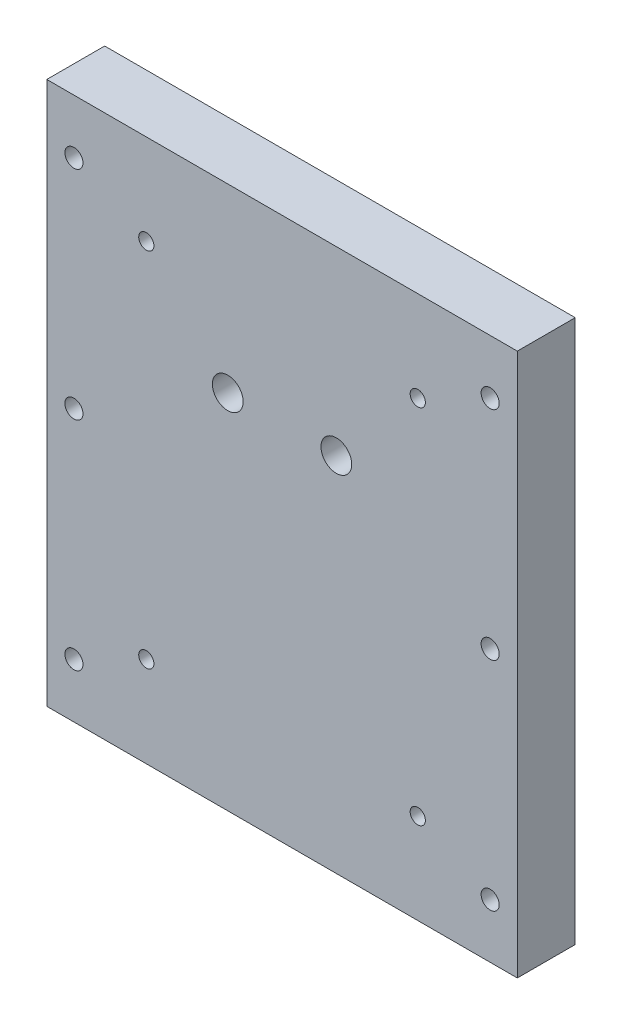
ISO-10303-21;
HEADER;
FILE_DESCRIPTION(('STEP AP214'),'2;1');
FILE_NAME('part.step','',(''),(''),'','','');
FILE_SCHEMA(('AUTOMOTIVE_DESIGN { 1 0 10303 214 1 1 1 1 }'));
ENDSEC;
DATA;
#1=APPLICATION_CONTEXT('core data for automotive mechanical design processes');
#2=APPLICATION_PROTOCOL_DEFINITION('international standard','automotive_design',2000,#1);
#3=PRODUCT_CONTEXT('',#1,'mechanical');
#4=PRODUCT('Part','Part','',(#3));
#5=PRODUCT_RELATED_PRODUCT_CATEGORY('part','',(#4));
#6=PRODUCT_DEFINITION_FORMATION('','',#4);
#7=PRODUCT_DEFINITION_CONTEXT('part definition',#1,'design');
#8=PRODUCT_DEFINITION('design','',#6,#7);
#9=PRODUCT_DEFINITION_SHAPE('','',#8);
#10=(LENGTH_UNIT() NAMED_UNIT(*) SI_UNIT(.MILLI.,.METRE.));
#11=(NAMED_UNIT(*) PLANE_ANGLE_UNIT() SI_UNIT($,.RADIAN.));
#12=(NAMED_UNIT(*) SI_UNIT($,.STERADIAN.) SOLID_ANGLE_UNIT());
#13=UNCERTAINTY_MEASURE_WITH_UNIT(LENGTH_MEASURE(1.E-05),#10,'distance_accuracy_value','');
#14=(GEOMETRIC_REPRESENTATION_CONTEXT(3) GLOBAL_UNCERTAINTY_ASSIGNED_CONTEXT((#13)) GLOBAL_UNIT_ASSIGNED_CONTEXT((#10,
#11,#12)) REPRESENTATION_CONTEXT('',''));
#15=CARTESIAN_POINT('',(0.,0.,0.));
#16=DIRECTION('',(0.,0.,1.));
#17=DIRECTION('',(1.,0.,0.));
#18=AXIS2_PLACEMENT_3D('',#15,#16,#17);
#19=CARTESIAN_POINT('',(0.,0.,0.));
#20=DIRECTION('',(0.,0.,1.));
#21=DIRECTION('',(1.,0.,0.));
#22=AXIS2_PLACEMENT_3D('',#19,#20,#21);
#23=PLANE('',#22);
#24=CARTESIAN_POINT('',(14.9999999999999,25.0000000000001,0.));
#25=DIRECTION('',(0.,0.,-1.));
#26=DIRECTION('',(-1.,0.,0.));
#27=AXIS2_PLACEMENT_3D('',#24,#25,#26);
#28=CIRCLE('',#27,4.25);
#29=CARTESIAN_POINT('',(10.7499999999999,25.0000000000001,0.));
#30=VERTEX_POINT('',#29);
#31=EDGE_CURVE('E182',#30,#30,#28,.T.);
#32=ORIENTED_EDGE('',*,*,#31,.F.);
#33=EDGE_LOOP('',(#32));
#34=FACE_BOUND('',#33,.T.);
#35=CARTESIAN_POINT('',(-37.5,50.,0.));
#36=DIRECTION('',(0.,0.,1.));
#37=DIRECTION('',(1.,0.,0.));
#38=AXIS2_PLACEMENT_3D('',#35,#36,#37);
#39=CIRCLE('',#38,2.09999999999999);
#40=CARTESIAN_POINT('',(-35.4,50.,0.));
#41=VERTEX_POINT('',#40);
#42=EDGE_CURVE('E173',#41,#41,#39,.T.);
#43=ORIENTED_EDGE('',*,*,#42,.T.);
#44=EDGE_LOOP('',(#43));
#45=FACE_BOUND('',#44,.T.);
#46=CARTESIAN_POINT('',(37.5,50.,0.));
#47=DIRECTION('',(0.,0.,1.));
#48=DIRECTION('',(1.,0.,0.));
#49=AXIS2_PLACEMENT_3D('',#46,#47,#48);
#50=CIRCLE('',#49,2.09999999999999);
#51=CARTESIAN_POINT('',(39.5999999999999,50.,0.));
#52=VERTEX_POINT('',#51);
#53=EDGE_CURVE('E167',#52,#52,#50,.T.);
#54=ORIENTED_EDGE('',*,*,#53,.T.);
#55=EDGE_LOOP('',(#54));
#56=FACE_BOUND('',#55,.T.);
#57=CARTESIAN_POINT('',(37.5,-50.,0.));
#58=DIRECTION('',(0.,0.,1.));
#59=DIRECTION('',(1.,0.,0.));
#60=AXIS2_PLACEMENT_3D('',#57,#58,#59);
#61=CIRCLE('',#60,2.09999999999999);
#62=CARTESIAN_POINT('',(39.5999999999999,-50.,0.));
#63=VERTEX_POINT('',#62);
#64=EDGE_CURVE('E161',#63,#63,#61,.T.);
#65=ORIENTED_EDGE('',*,*,#64,.T.);
#66=EDGE_LOOP('',(#65));
#67=FACE_BOUND('',#66,.T.);
#68=CARTESIAN_POINT('',(-37.5,-50.,0.));
#69=DIRECTION('',(0.,0.,1.));
#70=DIRECTION('',(1.,0.,0.));
#71=AXIS2_PLACEMENT_3D('',#68,#69,#70);
#72=CIRCLE('',#71,2.09999999999999);
#73=CARTESIAN_POINT('',(-35.4,-50.,0.));
#74=VERTEX_POINT('',#73);
#75=EDGE_CURVE('E155',#74,#74,#72,.T.);
#76=ORIENTED_EDGE('',*,*,#75,.T.);
#77=EDGE_LOOP('',(#76));
#78=FACE_BOUND('',#77,.T.);
#79=CARTESIAN_POINT('',(-57.5,60.,0.));
#80=DIRECTION('',(0.,0.,1.));
#81=DIRECTION('',(1.,0.,0.));
#82=AXIS2_PLACEMENT_3D('',#79,#80,#81);
#83=CIRCLE('',#82,2.5);
#84=CARTESIAN_POINT('',(-55.,60.,0.));
#85=VERTEX_POINT('',#84);
#86=EDGE_CURVE('E149',#85,#85,#83,.T.);
#87=ORIENTED_EDGE('',*,*,#86,.T.);
#88=EDGE_LOOP('',(#87));
#89=FACE_BOUND('',#88,.T.);
#90=CARTESIAN_POINT('',(-57.5,0.,0.));
#91=DIRECTION('',(0.,0.,1.));
#92=DIRECTION('',(1.,0.,0.));
#93=AXIS2_PLACEMENT_3D('',#90,#91,#92);
#94=CIRCLE('',#93,2.5);
#95=CARTESIAN_POINT('',(-55.,0.,0.));
#96=VERTEX_POINT('',#95);
#97=EDGE_CURVE('E143',#96,#96,#94,.T.);
#98=ORIENTED_EDGE('',*,*,#97,.T.);
#99=EDGE_LOOP('',(#98));
#100=FACE_BOUND('',#99,.T.);
#101=CARTESIAN_POINT('',(-57.5,-60.,0.));
#102=DIRECTION('',(0.,0.,1.));
#103=DIRECTION('',(1.,0.,0.));
#104=AXIS2_PLACEMENT_3D('',#101,#102,#103);
#105=CIRCLE('',#104,2.5);
#106=CARTESIAN_POINT('',(-55.,-60.,0.));
#107=VERTEX_POINT('',#106);
#108=EDGE_CURVE('E137',#107,#107,#105,.T.);
#109=ORIENTED_EDGE('',*,*,#108,.T.);
#110=EDGE_LOOP('',(#109));
#111=FACE_BOUND('',#110,.T.);
#112=CARTESIAN_POINT('',(57.5,-60.,0.));
#113=DIRECTION('',(0.,0.,1.));
#114=DIRECTION('',(1.,0.,0.));
#115=AXIS2_PLACEMENT_3D('',#112,#113,#114);
#116=CIRCLE('',#115,2.5);
#117=CARTESIAN_POINT('',(60.,-60.,0.));
#118=VERTEX_POINT('',#117);
#119=EDGE_CURVE('E131',#118,#118,#116,.T.);
#120=ORIENTED_EDGE('',*,*,#119,.T.);
#121=EDGE_LOOP('',(#120));
#122=FACE_BOUND('',#121,.T.);
#123=CARTESIAN_POINT('',(57.5,0.,0.));
#124=DIRECTION('',(0.,0.,1.));
#125=DIRECTION('',(1.,0.,0.));
#126=AXIS2_PLACEMENT_3D('',#123,#124,#125);
#127=CIRCLE('',#126,2.5);
#128=CARTESIAN_POINT('',(60.,0.,0.));
#129=VERTEX_POINT('',#128);
#130=EDGE_CURVE('E125',#129,#129,#127,.T.);
#131=ORIENTED_EDGE('',*,*,#130,.T.);
#132=EDGE_LOOP('',(#131));
#133=FACE_BOUND('',#132,.T.);
#134=CARTESIAN_POINT('',(57.5,60.,0.));
#135=DIRECTION('',(0.,0.,1.));
#136=DIRECTION('',(1.,0.,0.));
#137=AXIS2_PLACEMENT_3D('',#134,#135,#136);
#138=CIRCLE('',#137,2.5);
#139=CARTESIAN_POINT('',(60.,60.,0.));
#140=VERTEX_POINT('',#139);
#141=EDGE_CURVE('E109',#140,#140,#138,.T.);
#142=ORIENTED_EDGE('',*,*,#141,.T.);
#143=EDGE_LOOP('',(#142));
#144=FACE_BOUND('',#143,.T.);
#145=DIRECTION('',(0.,1.,0.));
#146=VECTOR('',#145,1.);
#147=CARTESIAN_POINT('',(65.,75.,0.));
#148=LINE('',#147,#146);
#149=CARTESIAN_POINT('',(65.,-75.,0.));
#150=VERTEX_POINT('',#149);
#151=CARTESIAN_POINT('',(65.,75.,0.));
#152=VERTEX_POINT('',#151);
#153=EDGE_CURVE('E106',#150,#152,#148,.T.);
#154=ORIENTED_EDGE('',*,*,#153,.F.);
#155=DIRECTION('',(1.,0.,0.));
#156=VECTOR('',#155,1.);
#157=CARTESIAN_POINT('',(-65.,-75.,0.));
#158=LINE('',#157,#156);
#159=CARTESIAN_POINT('',(-65.,-75.,0.));
#160=VERTEX_POINT('',#159);
#161=EDGE_CURVE('E81',#160,#150,#158,.T.);
#162=ORIENTED_EDGE('',*,*,#161,.F.);
#163=DIRECTION('',(0.,-1.,0.));
#164=VECTOR('',#163,1.);
#165=CARTESIAN_POINT('',(-65.,75.,0.));
#166=LINE('',#165,#164);
#167=CARTESIAN_POINT('',(-65.,75.,0.));
#168=VERTEX_POINT('',#167);
#169=EDGE_CURVE('E75',#168,#160,#166,.T.);
#170=ORIENTED_EDGE('',*,*,#169,.F.);
#171=DIRECTION('',(-1.,0.,0.));
#172=VECTOR('',#171,1.);
#173=CARTESIAN_POINT('',(-65.,75.,0.));
#174=LINE('',#173,#172);
#175=EDGE_CURVE('E97',#152,#168,#174,.T.);
#176=ORIENTED_EDGE('',*,*,#175,.F.);
#177=EDGE_LOOP('',(#154,#162,#170,#176));
#178=FACE_BOUND('',#177,.T.);
#179=CARTESIAN_POINT('',(-14.9999999999999,25.0000000000001,0.));
#180=DIRECTION('',(0.,0.,-1.));
#181=DIRECTION('',(-1.,0.,0.));
#182=AXIS2_PLACEMENT_3D('',#179,#180,#181);
#183=CIRCLE('',#182,4.24999999999999);
#184=CARTESIAN_POINT('',(-19.2499999999999,25.0000000000001,0.));
#185=VERTEX_POINT('',#184);
#186=EDGE_CURVE('E185',#185,#185,#183,.T.);
#187=ORIENTED_EDGE('',*,*,#186,.F.);
#188=EDGE_LOOP('',(#187));
#189=FACE_BOUND('',#188,.T.);
#190=ADVANCED_FACE('F40',(#34,#45,#56,#67,#78,#89,#100,#111,#122,#133,#144,#178,#189),#23,.F.);
#191=CARTESIAN_POINT('',(65.,75.,16.));
#192=DIRECTION('',(-1.,0.,0.));
#193=DIRECTION('',(0.,-1.,0.));
#194=AXIS2_PLACEMENT_3D('',#191,#192,#193);
#195=PLANE('',#194);
#196=ORIENTED_EDGE('',*,*,#153,.T.);
#197=DIRECTION('',(0.,0.,-1.));
#198=VECTOR('',#197,1.);
#199=CARTESIAN_POINT('',(65.,75.,16.));
#200=LINE('',#199,#198);
#201=CARTESIAN_POINT('',(65.,75.,16.));
#202=VERTEX_POINT('',#201);
#203=EDGE_CURVE('E11',#202,#152,#200,.T.);
#204=ORIENTED_EDGE('',*,*,#203,.F.);
#205=DIRECTION('',(0.,1.,0.));
#206=VECTOR('',#205,1.);
#207=CARTESIAN_POINT('',(65.,75.,16.));
#208=LINE('',#207,#206);
#209=CARTESIAN_POINT('',(65.,-75.,16.));
#210=VERTEX_POINT('',#209);
#211=EDGE_CURVE('E93',#210,#202,#208,.T.);
#212=ORIENTED_EDGE('',*,*,#211,.F.);
#213=DIRECTION('',(0.,0.,-1.));
#214=VECTOR('',#213,1.);
#215=CARTESIAN_POINT('',(65.,-75.,16.));
#216=LINE('',#215,#214);
#217=EDGE_CURVE('E102',#210,#150,#216,.T.);
#218=ORIENTED_EDGE('',*,*,#217,.T.);
#219=EDGE_LOOP('',(#196,#204,#212,#218));
#220=FACE_BOUND('',#219,.T.);
#221=ADVANCED_FACE('F42',(#220),#195,.F.);
#222=CARTESIAN_POINT('',(-65.,75.,16.));
#223=DIRECTION('',(0.,-1.,0.));
#224=DIRECTION('',(0.,0.,-1.));
#225=AXIS2_PLACEMENT_3D('',#222,#223,#224);
#226=PLANE('',#225);
#227=ORIENTED_EDGE('',*,*,#175,.T.);
#228=DIRECTION('',(0.,0.,-1.));
#229=VECTOR('',#228,1.);
#230=CARTESIAN_POINT('',(-65.,75.,16.));
#231=LINE('',#230,#229);
#232=CARTESIAN_POINT('',(-65.,75.,16.));
#233=VERTEX_POINT('',#232);
#234=EDGE_CURVE('E50',#233,#168,#231,.T.);
#235=ORIENTED_EDGE('',*,*,#234,.F.);
#236=DIRECTION('',(-1.,0.,0.));
#237=VECTOR('',#236,1.);
#238=CARTESIAN_POINT('',(-65.,75.,16.));
#239=LINE('',#238,#237);
#240=EDGE_CURVE('E88',#202,#233,#239,.T.);
#241=ORIENTED_EDGE('',*,*,#240,.F.);
#242=ORIENTED_EDGE('',*,*,#203,.T.);
#243=EDGE_LOOP('',(#227,#235,#241,#242));
#244=FACE_BOUND('',#243,.T.);
#245=ADVANCED_FACE('F96',(#244),#226,.F.);
#246=CARTESIAN_POINT('',(-65.,75.,16.));
#247=DIRECTION('',(1.,0.,0.));
#248=DIRECTION('',(0.,1.,0.));
#249=AXIS2_PLACEMENT_3D('',#246,#247,#248);
#250=PLANE('',#249);
#251=ORIENTED_EDGE('',*,*,#169,.T.);
#252=DIRECTION('',(0.,0.,-1.));
#253=VECTOR('',#252,1.);
#254=CARTESIAN_POINT('',(-65.,-75.,16.));
#255=LINE('',#254,#253);
#256=CARTESIAN_POINT('',(-65.,-75.,16.));
#257=VERTEX_POINT('',#256);
#258=EDGE_CURVE('E98',#257,#160,#255,.T.);
#259=ORIENTED_EDGE('',*,*,#258,.F.);
#260=DIRECTION('',(0.,-1.,0.));
#261=VECTOR('',#260,1.);
#262=CARTESIAN_POINT('',(-65.,75.,16.));
#263=LINE('',#262,#261);
#264=EDGE_CURVE('E91',#233,#257,#263,.T.);
#265=ORIENTED_EDGE('',*,*,#264,.F.);
#266=ORIENTED_EDGE('',*,*,#234,.T.);
#267=EDGE_LOOP('',(#251,#259,#265,#266));
#268=FACE_BOUND('',#267,.T.);
#269=ADVANCED_FACE('F100',(#268),#250,.F.);
#270=CARTESIAN_POINT('',(-65.,-75.,16.));
#271=DIRECTION('',(0.,1.,0.));
#272=DIRECTION('',(0.,0.,1.));
#273=AXIS2_PLACEMENT_3D('',#270,#271,#272);
#274=PLANE('',#273);
#275=ORIENTED_EDGE('',*,*,#161,.T.);
#276=ORIENTED_EDGE('',*,*,#217,.F.);
#277=DIRECTION('',(1.,0.,0.));
#278=VECTOR('',#277,1.);
#279=CARTESIAN_POINT('',(-65.,-75.,16.));
#280=LINE('',#279,#278);
#281=EDGE_CURVE('E58',#257,#210,#280,.T.);
#282=ORIENTED_EDGE('',*,*,#281,.F.);
#283=ORIENTED_EDGE('',*,*,#258,.T.);
#284=EDGE_LOOP('',(#275,#276,#282,#283));
#285=FACE_BOUND('',#284,.T.);
#286=ADVANCED_FACE('F114',(#285),#274,.F.);
#287=CARTESIAN_POINT('',(0.,0.,16.));
#288=DIRECTION('',(0.,0.,1.));
#289=DIRECTION('',(1.,0.,0.));
#290=AXIS2_PLACEMENT_3D('',#287,#288,#289);
#291=PLANE('',#290);
#292=CARTESIAN_POINT('',(-14.9999999999999,25.0000000000001,16.));
#293=DIRECTION('',(0.,0.,1.));
#294=DIRECTION('',(1.,0.,0.));
#295=AXIS2_PLACEMENT_3D('',#292,#293,#294);
#296=CIRCLE('',#295,4.24999999999999);
#297=CARTESIAN_POINT('',(-10.7499999999999,25.0000000000001,16.));
#298=VERTEX_POINT('',#297);
#299=EDGE_CURVE('E44',#298,#298,#296,.T.);
#300=ORIENTED_EDGE('',*,*,#299,.F.);
#301=EDGE_LOOP('',(#300));
#302=FACE_BOUND('',#301,.T.);
#303=CARTESIAN_POINT('',(14.9999999999999,25.0000000000001,16.));
#304=DIRECTION('',(0.,0.,1.));
#305=DIRECTION('',(1.,0.,0.));
#306=AXIS2_PLACEMENT_3D('',#303,#304,#305);
#307=CIRCLE('',#306,4.24999999999999);
#308=CARTESIAN_POINT('',(19.2499999999999,25.0000000000001,16.));
#309=VERTEX_POINT('',#308);
#310=EDGE_CURVE('E179',#309,#309,#307,.T.);
#311=ORIENTED_EDGE('',*,*,#310,.F.);
#312=EDGE_LOOP('',(#311));
#313=FACE_BOUND('',#312,.T.);
#314=CARTESIAN_POINT('',(-37.5,50.,16.));
#315=DIRECTION('',(0.,0.,1.));
#316=DIRECTION('',(1.,0.,0.));
#317=AXIS2_PLACEMENT_3D('',#314,#315,#316);
#318=CIRCLE('',#317,2.09999999999999);
#319=CARTESIAN_POINT('',(-35.4,50.,16.));
#320=VERTEX_POINT('',#319);
#321=EDGE_CURVE('E176',#320,#320,#318,.T.);
#322=ORIENTED_EDGE('',*,*,#321,.F.);
#323=EDGE_LOOP('',(#322));
#324=FACE_BOUND('',#323,.T.);
#325=CARTESIAN_POINT('',(37.5,50.,16.));
#326=DIRECTION('',(0.,0.,1.));
#327=DIRECTION('',(1.,0.,0.));
#328=AXIS2_PLACEMENT_3D('',#325,#326,#327);
#329=CIRCLE('',#328,2.09999999999999);
#330=CARTESIAN_POINT('',(39.5999999999999,50.,16.));
#331=VERTEX_POINT('',#330);
#332=EDGE_CURVE('E170',#331,#331,#329,.T.);
#333=ORIENTED_EDGE('',*,*,#332,.F.);
#334=EDGE_LOOP('',(#333));
#335=FACE_BOUND('',#334,.T.);
#336=CARTESIAN_POINT('',(37.5,-50.,16.));
#337=DIRECTION('',(0.,0.,1.));
#338=DIRECTION('',(1.,0.,0.));
#339=AXIS2_PLACEMENT_3D('',#336,#337,#338);
#340=CIRCLE('',#339,2.09999999999999);
#341=CARTESIAN_POINT('',(39.5999999999999,-50.,16.));
#342=VERTEX_POINT('',#341);
#343=EDGE_CURVE('E164',#342,#342,#340,.T.);
#344=ORIENTED_EDGE('',*,*,#343,.F.);
#345=EDGE_LOOP('',(#344));
#346=FACE_BOUND('',#345,.T.);
#347=CARTESIAN_POINT('',(-37.5,-50.,16.));
#348=DIRECTION('',(0.,0.,1.));
#349=DIRECTION('',(1.,0.,0.));
#350=AXIS2_PLACEMENT_3D('',#347,#348,#349);
#351=CIRCLE('',#350,2.09999999999999);
#352=CARTESIAN_POINT('',(-35.4,-50.,16.));
#353=VERTEX_POINT('',#352);
#354=EDGE_CURVE('E158',#353,#353,#351,.T.);
#355=ORIENTED_EDGE('',*,*,#354,.F.);
#356=EDGE_LOOP('',(#355));
#357=FACE_BOUND('',#356,.T.);
#358=CARTESIAN_POINT('',(-57.5,60.,16.));
#359=DIRECTION('',(0.,0.,1.));
#360=DIRECTION('',(1.,0.,0.));
#361=AXIS2_PLACEMENT_3D('',#358,#359,#360);
#362=CIRCLE('',#361,2.5);
#363=CARTESIAN_POINT('',(-55.,60.,16.));
#364=VERTEX_POINT('',#363);
#365=EDGE_CURVE('E152',#364,#364,#362,.T.);
#366=ORIENTED_EDGE('',*,*,#365,.F.);
#367=EDGE_LOOP('',(#366));
#368=FACE_BOUND('',#367,.T.);
#369=CARTESIAN_POINT('',(-57.5,0.,16.));
#370=DIRECTION('',(0.,0.,1.));
#371=DIRECTION('',(1.,0.,0.));
#372=AXIS2_PLACEMENT_3D('',#369,#370,#371);
#373=CIRCLE('',#372,2.5);
#374=CARTESIAN_POINT('',(-55.,0.,16.));
#375=VERTEX_POINT('',#374);
#376=EDGE_CURVE('E146',#375,#375,#373,.T.);
#377=ORIENTED_EDGE('',*,*,#376,.F.);
#378=EDGE_LOOP('',(#377));
#379=FACE_BOUND('',#378,.T.);
#380=CARTESIAN_POINT('',(-57.5,-60.,16.));
#381=DIRECTION('',(0.,0.,1.));
#382=DIRECTION('',(1.,0.,0.));
#383=AXIS2_PLACEMENT_3D('',#380,#381,#382);
#384=CIRCLE('',#383,2.5);
#385=CARTESIAN_POINT('',(-55.,-60.,16.));
#386=VERTEX_POINT('',#385);
#387=EDGE_CURVE('E140',#386,#386,#384,.T.);
#388=ORIENTED_EDGE('',*,*,#387,.F.);
#389=EDGE_LOOP('',(#388));
#390=FACE_BOUND('',#389,.T.);
#391=CARTESIAN_POINT('',(57.5,-60.,16.));
#392=DIRECTION('',(0.,0.,1.));
#393=DIRECTION('',(1.,0.,0.));
#394=AXIS2_PLACEMENT_3D('',#391,#392,#393);
#395=CIRCLE('',#394,2.5);
#396=CARTESIAN_POINT('',(60.,-60.,16.));
#397=VERTEX_POINT('',#396);
#398=EDGE_CURVE('E134',#397,#397,#395,.T.);
#399=ORIENTED_EDGE('',*,*,#398,.F.);
#400=EDGE_LOOP('',(#399));
#401=FACE_BOUND('',#400,.T.);
#402=CARTESIAN_POINT('',(57.5,0.,16.));
#403=DIRECTION('',(0.,0.,1.));
#404=DIRECTION('',(1.,0.,0.));
#405=AXIS2_PLACEMENT_3D('',#402,#403,#404);
#406=CIRCLE('',#405,2.5);
#407=CARTESIAN_POINT('',(60.,0.,16.));
#408=VERTEX_POINT('',#407);
#409=EDGE_CURVE('E128',#408,#408,#406,.T.);
#410=ORIENTED_EDGE('',*,*,#409,.F.);
#411=EDGE_LOOP('',(#410));
#412=FACE_BOUND('',#411,.T.);
#413=CARTESIAN_POINT('',(57.5,60.,16.));
#414=DIRECTION('',(0.,0.,1.));
#415=DIRECTION('',(1.,0.,0.));
#416=AXIS2_PLACEMENT_3D('',#413,#414,#415);
#417=CIRCLE('',#416,2.5);
#418=CARTESIAN_POINT('',(60.,60.,16.));
#419=VERTEX_POINT('',#418);
#420=EDGE_CURVE('E122',#419,#419,#417,.T.);
#421=ORIENTED_EDGE('',*,*,#420,.F.);
#422=EDGE_LOOP('',(#421));
#423=FACE_BOUND('',#422,.T.);
#424=ORIENTED_EDGE('',*,*,#211,.T.);
#425=ORIENTED_EDGE('',*,*,#240,.T.);
#426=ORIENTED_EDGE('',*,*,#264,.T.);
#427=ORIENTED_EDGE('',*,*,#281,.T.);
#428=EDGE_LOOP('',(#424,#425,#426,#427));
#429=FACE_BOUND('',#428,.T.);
#430=ADVANCED_FACE('F89',(#302,#313,#324,#335,#346,#357,#368,#379,#390,#401,#412,#423,#429),
#291,.T.);
#431=CARTESIAN_POINT('',(57.5,60.,16.));
#432=DIRECTION('',(0.,0.,1.));
#433=DIRECTION('',(1.,0.,0.));
#434=AXIS2_PLACEMENT_3D('',#431,#432,#433);
#435=CYLINDRICAL_SURFACE('',#434,2.5);
#436=ORIENTED_EDGE('',*,*,#141,.F.);
#437=EDGE_LOOP('',(#436));
#438=FACE_BOUND('',#437,.T.);
#439=ORIENTED_EDGE('',*,*,#420,.T.);
#440=EDGE_LOOP('',(#439));
#441=FACE_BOUND('',#440,.T.);
#442=ADVANCED_FACE('F196',(#438,#441),#435,.F.);
#443=CARTESIAN_POINT('',(57.5,0.,16.));
#444=DIRECTION('',(0.,0.,1.));
#445=DIRECTION('',(1.,0.,0.));
#446=AXIS2_PLACEMENT_3D('',#443,#444,#445);
#447=CYLINDRICAL_SURFACE('',#446,2.5);
#448=ORIENTED_EDGE('',*,*,#130,.F.);
#449=EDGE_LOOP('',(#448));
#450=FACE_BOUND('',#449,.T.);
#451=ORIENTED_EDGE('',*,*,#409,.T.);
#452=EDGE_LOOP('',(#451));
#453=FACE_BOUND('',#452,.T.);
#454=ADVANCED_FACE('F221',(#450,#453),#447,.F.);
#455=CARTESIAN_POINT('',(57.5,-60.,16.));
#456=DIRECTION('',(0.,0.,1.));
#457=DIRECTION('',(1.,0.,0.));
#458=AXIS2_PLACEMENT_3D('',#455,#456,#457);
#459=CYLINDRICAL_SURFACE('',#458,2.5);
#460=ORIENTED_EDGE('',*,*,#119,.F.);
#461=EDGE_LOOP('',(#460));
#462=FACE_BOUND('',#461,.T.);
#463=ORIENTED_EDGE('',*,*,#398,.T.);
#464=EDGE_LOOP('',(#463));
#465=FACE_BOUND('',#464,.T.);
#466=ADVANCED_FACE('F227',(#462,#465),#459,.F.);
#467=CARTESIAN_POINT('',(-57.5,-60.,16.));
#468=DIRECTION('',(0.,0.,1.));
#469=DIRECTION('',(1.,0.,0.));
#470=AXIS2_PLACEMENT_3D('',#467,#468,#469);
#471=CYLINDRICAL_SURFACE('',#470,2.5);
#472=ORIENTED_EDGE('',*,*,#108,.F.);
#473=EDGE_LOOP('',(#472));
#474=FACE_BOUND('',#473,.T.);
#475=ORIENTED_EDGE('',*,*,#387,.T.);
#476=EDGE_LOOP('',(#475));
#477=FACE_BOUND('',#476,.T.);
#478=ADVANCED_FACE('F364',(#474,#477),#471,.F.);
#479=CARTESIAN_POINT('',(-57.5,0.,16.));
#480=DIRECTION('',(0.,0.,1.));
#481=DIRECTION('',(1.,0.,0.));
#482=AXIS2_PLACEMENT_3D('',#479,#480,#481);
#483=CYLINDRICAL_SURFACE('',#482,2.5);
#484=ORIENTED_EDGE('',*,*,#97,.F.);
#485=EDGE_LOOP('',(#484));
#486=FACE_BOUND('',#485,.T.);
#487=ORIENTED_EDGE('',*,*,#376,.T.);
#488=EDGE_LOOP('',(#487));
#489=FACE_BOUND('',#488,.T.);
#490=ADVANCED_FACE('F351',(#486,#489),#483,.F.);
#491=CARTESIAN_POINT('',(-57.5,60.,16.));
#492=DIRECTION('',(0.,0.,1.));
#493=DIRECTION('',(1.,0.,0.));
#494=AXIS2_PLACEMENT_3D('',#491,#492,#493);
#495=CYLINDRICAL_SURFACE('',#494,2.5);
#496=ORIENTED_EDGE('',*,*,#86,.F.);
#497=EDGE_LOOP('',(#496));
#498=FACE_BOUND('',#497,.T.);
#499=ORIENTED_EDGE('',*,*,#365,.T.);
#500=EDGE_LOOP('',(#499));
#501=FACE_BOUND('',#500,.T.);
#502=ADVANCED_FACE('F339',(#498,#501),#495,.F.);
#503=CARTESIAN_POINT('',(-37.5,-50.,16.));
#504=DIRECTION('',(0.,0.,1.));
#505=DIRECTION('',(1.,0.,0.));
#506=AXIS2_PLACEMENT_3D('',#503,#504,#505);
#507=CYLINDRICAL_SURFACE('',#506,2.09999999999999);
#508=ORIENTED_EDGE('',*,*,#75,.F.);
#509=EDGE_LOOP('',(#508));
#510=FACE_BOUND('',#509,.T.);
#511=ORIENTED_EDGE('',*,*,#354,.T.);
#512=EDGE_LOOP('',(#511));
#513=FACE_BOUND('',#512,.T.);
#514=ADVANCED_FACE('F326',(#510,#513),#507,.F.);
#515=CARTESIAN_POINT('',(37.5,-50.,16.));
#516=DIRECTION('',(0.,0.,1.));
#517=DIRECTION('',(1.,0.,0.));
#518=AXIS2_PLACEMENT_3D('',#515,#516,#517);
#519=CYLINDRICAL_SURFACE('',#518,2.09999999999999);
#520=ORIENTED_EDGE('',*,*,#64,.F.);
#521=EDGE_LOOP('',(#520));
#522=FACE_BOUND('',#521,.T.);
#523=ORIENTED_EDGE('',*,*,#343,.T.);
#524=EDGE_LOOP('',(#523));
#525=FACE_BOUND('',#524,.T.);
#526=ADVANCED_FACE('F313',(#522,#525),#519,.F.);
#527=CARTESIAN_POINT('',(37.5,50.,16.));
#528=DIRECTION('',(0.,0.,1.));
#529=DIRECTION('',(1.,0.,0.));
#530=AXIS2_PLACEMENT_3D('',#527,#528,#529);
#531=CYLINDRICAL_SURFACE('',#530,2.09999999999999);
#532=ORIENTED_EDGE('',*,*,#53,.F.);
#533=EDGE_LOOP('',(#532));
#534=FACE_BOUND('',#533,.T.);
#535=ORIENTED_EDGE('',*,*,#332,.T.);
#536=EDGE_LOOP('',(#535));
#537=FACE_BOUND('',#536,.T.);
#538=ADVANCED_FACE('F302',(#534,#537),#531,.F.);
#539=CARTESIAN_POINT('',(-37.5,50.,16.));
#540=DIRECTION('',(0.,0.,1.));
#541=DIRECTION('',(1.,0.,0.));
#542=AXIS2_PLACEMENT_3D('',#539,#540,#541);
#543=CYLINDRICAL_SURFACE('',#542,2.09999999999999);
#544=ORIENTED_EDGE('',*,*,#42,.F.);
#545=EDGE_LOOP('',(#544));
#546=FACE_BOUND('',#545,.T.);
#547=ORIENTED_EDGE('',*,*,#321,.T.);
#548=EDGE_LOOP('',(#547));
#549=FACE_BOUND('',#548,.T.);
#550=ADVANCED_FACE('F290',(#546,#549),#543,.F.);
#551=CARTESIAN_POINT('',(14.9999999999999,25.0000000000001,0.));
#552=DIRECTION('',(0.,0.,-1.));
#553=DIRECTION('',(-1.,0.,0.));
#554=AXIS2_PLACEMENT_3D('',#551,#552,#553);
#555=CYLINDRICAL_SURFACE('',#554,4.24999999999999);
#556=ORIENTED_EDGE('',*,*,#310,.T.);
#557=EDGE_LOOP('',(#556));
#558=FACE_BOUND('',#557,.T.);
#559=ORIENTED_EDGE('',*,*,#31,.T.);
#560=EDGE_LOOP('',(#559));
#561=FACE_BOUND('',#560,.T.);
#562=ADVANCED_FACE('F277',(#558,#561),#555,.F.);
#563=CARTESIAN_POINT('',(-14.9999999999999,25.0000000000001,0.));
#564=DIRECTION('',(0.,0.,-1.));
#565=DIRECTION('',(-1.,0.,0.));
#566=AXIS2_PLACEMENT_3D('',#563,#564,#565);
#567=CYLINDRICAL_SURFACE('',#566,4.24999999999999);
#568=ORIENTED_EDGE('',*,*,#299,.T.);
#569=EDGE_LOOP('',(#568));
#570=FACE_BOUND('',#569,.T.);
#571=ORIENTED_EDGE('',*,*,#186,.T.);
#572=EDGE_LOOP('',(#571));
#573=FACE_BOUND('',#572,.T.);
#574=ADVANCED_FACE('F192',(#570,#573),#567,.F.);
#575=CLOSED_SHELL('',(#190,#221,#245,#269,#286,#430,#442,#454,#466,#478,#490,#502,#514,#526,
#538,#550,#562,#574));
#576=MANIFOLD_SOLID_BREP('B2',#575);
#577=ADVANCED_BREP_SHAPE_REPRESENTATION('',(#18,#576),#14);
#578=SHAPE_DEFINITION_REPRESENTATION(#9,#577);
ENDSEC;
END-ISO-10303-21;
